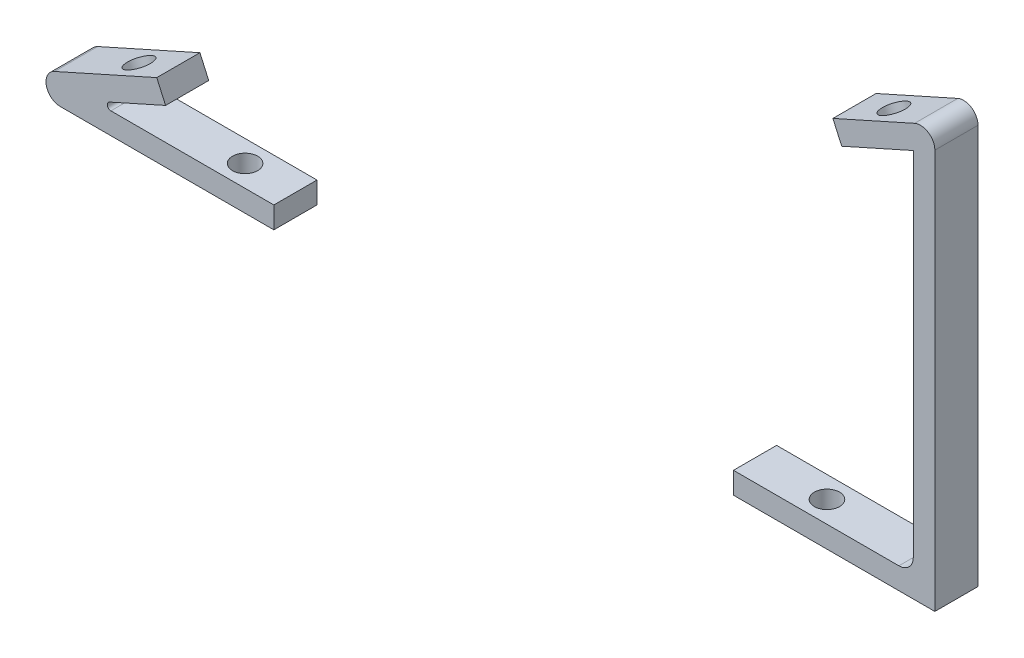
ISO-10303-21;
HEADER;
FILE_DESCRIPTION(('STEP AP214'),'2;1');
FILE_NAME('part.step','',(''),(''),'','','');
FILE_SCHEMA(('AUTOMOTIVE_DESIGN { 1 0 10303 214 1 1 1 1 }'));
ENDSEC;
DATA;
#1=APPLICATION_CONTEXT('core data for automotive mechanical design processes');
#2=APPLICATION_PROTOCOL_DEFINITION('international standard','automotive_design',2000,#1);
#3=PRODUCT_CONTEXT('',#1,'mechanical');
#4=PRODUCT('Part','Part','',(#3));
#5=PRODUCT_RELATED_PRODUCT_CATEGORY('part','',(#4));
#6=PRODUCT_DEFINITION_FORMATION('','',#4);
#7=PRODUCT_DEFINITION_CONTEXT('part definition',#1,'design');
#8=PRODUCT_DEFINITION('design','',#6,#7);
#9=PRODUCT_DEFINITION_SHAPE('','',#8);
#10=(LENGTH_UNIT() NAMED_UNIT(*) SI_UNIT(.MILLI.,.METRE.));
#11=(NAMED_UNIT(*) PLANE_ANGLE_UNIT() SI_UNIT($,.RADIAN.));
#12=(NAMED_UNIT(*) SI_UNIT($,.STERADIAN.) SOLID_ANGLE_UNIT());
#13=UNCERTAINTY_MEASURE_WITH_UNIT(LENGTH_MEASURE(1.E-05),#10,'distance_accuracy_value','');
#14=(GEOMETRIC_REPRESENTATION_CONTEXT(3) GLOBAL_UNCERTAINTY_ASSIGNED_CONTEXT((#13)) GLOBAL_UNIT_ASSIGNED_CONTEXT((#10,
#11,#12)) REPRESENTATION_CONTEXT('',''));
#15=CARTESIAN_POINT('',(0.,0.,0.));
#16=DIRECTION('',(0.,0.,1.));
#17=DIRECTION('',(1.,0.,0.));
#18=AXIS2_PLACEMENT_3D('',#15,#16,#17);
#19=CARTESIAN_POINT('',(89.9,52.5434299792377,6.));
#20=DIRECTION('',(0.,0.,1.));
#21=DIRECTION('',(1.,0.,0.));
#22=AXIS2_PLACEMENT_3D('',#19,#20,#21);
#23=CYLINDRICAL_SURFACE('',#22,2.);
#24=DIRECTION('',(0.,0.,1.));
#25=VECTOR('',#24,1.);
#26=CARTESIAN_POINT('',(91.9,52.5434299792376,6.));
#27=LINE('',#26,#25);
#28=CARTESIAN_POINT('',(91.9,52.5434299792376,0.));
#29=VERTEX_POINT('',#28);
#30=CARTESIAN_POINT('',(91.9,52.5434299792376,6.));
#31=VERTEX_POINT('',#30);
#32=EDGE_CURVE('E153',#29,#31,#27,.T.);
#33=ORIENTED_EDGE('',*,*,#32,.F.);
#34=CARTESIAN_POINT('',(89.9,52.5434299792377,0.));
#35=DIRECTION('',(0.,0.,1.));
#36=DIRECTION('',(1.,0.,0.));
#37=AXIS2_PLACEMENT_3D('',#34,#35,#36);
#38=CIRCLE('',#37,2.);
#39=CARTESIAN_POINT('',(89.0826705294979,54.3687991300257,0.));
#40=VERTEX_POINT('',#39);
#41=EDGE_CURVE('E167',#40,#29,#38,.F.);
#42=ORIENTED_EDGE('',*,*,#41,.F.);
#43=DIRECTION('',(0.,0.,1.));
#44=VECTOR('',#43,1.);
#45=CARTESIAN_POINT('',(89.0826705294979,54.3687991300257,6.));
#46=LINE('',#45,#44);
#47=CARTESIAN_POINT('',(89.0826705294979,54.3687991300257,6.));
#48=VERTEX_POINT('',#47);
#49=EDGE_CURVE('E158',#48,#40,#46,.F.);
#50=ORIENTED_EDGE('',*,*,#49,.F.);
#51=CARTESIAN_POINT('',(89.9,52.5434299792377,6.));
#52=DIRECTION('',(0.,0.,1.));
#53=DIRECTION('',(1.,0.,0.));
#54=AXIS2_PLACEMENT_3D('',#51,#52,#53);
#55=CIRCLE('',#54,2.);
#56=EDGE_CURVE('E170',#31,#48,#55,.T.);
#57=ORIENTED_EDGE('',*,*,#56,.F.);
#58=EDGE_LOOP('',(#33,#42,#50,#57));
#59=FACE_BOUND('',#58,.T.);
#60=ADVANCED_FACE('F48',(#59),#23,.T.);
#61=CARTESIAN_POINT('',(88.9,0.,6.));
#62=DIRECTION('',(0.,-1.,0.));
#63=DIRECTION('',(1.,0.,0.));
#64=AXIS2_PLACEMENT_3D('',#61,#62,#63);
#65=PLANE('',#64);
#66=CARTESIAN_POINT('',(73.9,0.,3.));
#67=DIRECTION('',(0.,1.,0.));
#68=DIRECTION('',(-1.,0.,0.));
#69=AXIS2_PLACEMENT_3D('',#66,#67,#68);
#70=CIRCLE('',#69,1.75);
#71=CARTESIAN_POINT('',(72.15,0.,3.));
#72=VERTEX_POINT('',#71);
#73=EDGE_CURVE('E306',#72,#72,#70,.T.);
#74=ORIENTED_EDGE('',*,*,#73,.F.);
#75=EDGE_LOOP('',(#74));
#76=FACE_BOUND('',#75,.T.);
#77=DIRECTION('',(-1.,0.,0.));
#78=VECTOR('',#77,1.);
#79=CARTESIAN_POINT('',(88.9,0.,6.));
#80=LINE('',#79,#78);
#81=CARTESIAN_POINT('',(86.9,0.,6.));
#82=VERTEX_POINT('',#81);
#83=CARTESIAN_POINT('',(63.9,0.,6.));
#84=VERTEX_POINT('',#83);
#85=EDGE_CURVE('E125',#82,#84,#80,.T.);
#86=ORIENTED_EDGE('',*,*,#85,.F.);
#87=DIRECTION('',(0.,0.,-1.));
#88=VECTOR('',#87,1.);
#89=CARTESIAN_POINT('',(86.9,0.,0.));
#90=LINE('',#89,#88);
#91=CARTESIAN_POINT('',(86.9,0.,0.));
#92=VERTEX_POINT('',#91);
#93=EDGE_CURVE('E173',#82,#92,#90,.T.);
#94=ORIENTED_EDGE('',*,*,#93,.T.);
#95=DIRECTION('',(-1.,0.,0.));
#96=VECTOR('',#95,1.);
#97=CARTESIAN_POINT('',(88.9,0.,0.));
#98=LINE('',#97,#96);
#99=CARTESIAN_POINT('',(63.9,0.,0.));
#100=VERTEX_POINT('',#99);
#101=EDGE_CURVE('E150',#92,#100,#98,.T.);
#102=ORIENTED_EDGE('',*,*,#101,.T.);
#103=DIRECTION('',(0.,0.,-1.));
#104=VECTOR('',#103,1.);
#105=CARTESIAN_POINT('',(63.9,0.,6.));
#106=LINE('',#105,#104);
#107=EDGE_CURVE('E142',#84,#100,#106,.T.);
#108=ORIENTED_EDGE('',*,*,#107,.F.);
#109=EDGE_LOOP('',(#86,#94,#102,#108));
#110=FACE_BOUND('',#109,.T.);
#111=ADVANCED_FACE('F149',(#76,#110),#65,.F.);
#112=CARTESIAN_POINT('',(63.9,0.,6.));
#113=DIRECTION('',(1.,0.,0.));
#114=DIRECTION('',(0.,0.,-1.));
#115=AXIS2_PLACEMENT_3D('',#112,#113,#114);
#116=PLANE('',#115);
#117=DIRECTION('',(0.,-1.,0.));
#118=VECTOR('',#117,1.);
#119=CARTESIAN_POINT('',(63.9,0.,0.));
#120=LINE('',#119,#118);
#121=CARTESIAN_POINT('',(63.9,-3.,0.));
#122=VERTEX_POINT('',#121);
#123=EDGE_CURVE('E182',#100,#122,#120,.T.);
#124=ORIENTED_EDGE('',*,*,#123,.T.);
#125=DIRECTION('',(0.,0.,-1.));
#126=VECTOR('',#125,1.);
#127=CARTESIAN_POINT('',(63.9,-3.,6.));
#128=LINE('',#127,#126);
#129=CARTESIAN_POINT('',(63.9,-3.,6.));
#130=VERTEX_POINT('',#129);
#131=EDGE_CURVE('E144',#130,#122,#128,.T.);
#132=ORIENTED_EDGE('',*,*,#131,.F.);
#133=DIRECTION('',(0.,-1.,0.));
#134=VECTOR('',#133,1.);
#135=CARTESIAN_POINT('',(63.9,0.,6.));
#136=LINE('',#135,#134);
#137=EDGE_CURVE('E129',#84,#130,#136,.T.);
#138=ORIENTED_EDGE('',*,*,#137,.F.);
#139=ORIENTED_EDGE('',*,*,#107,.T.);
#140=EDGE_LOOP('',(#124,#132,#138,#139));
#141=FACE_BOUND('',#140,.T.);
#142=ADVANCED_FACE('F141',(#141),#116,.F.);
#143=CARTESIAN_POINT('',(63.9,-3.,6.));
#144=DIRECTION('',(0.,1.,0.));
#145=DIRECTION('',(-1.,0.,0.));
#146=AXIS2_PLACEMENT_3D('',#143,#144,#145);
#147=PLANE('',#146);
#148=CARTESIAN_POINT('',(73.9,-2.99999999999999,3.));
#149=DIRECTION('',(0.,1.,0.));
#150=DIRECTION('',(-1.,0.,0.));
#151=AXIS2_PLACEMENT_3D('',#148,#149,#150);
#152=CIRCLE('',#151,1.75);
#153=CARTESIAN_POINT('',(72.15,-2.99999999999999,3.));
#154=VERTEX_POINT('',#153);
#155=EDGE_CURVE('E303',#154,#154,#152,.T.);
#156=ORIENTED_EDGE('',*,*,#155,.T.);
#157=EDGE_LOOP('',(#156));
#158=FACE_BOUND('',#157,.T.);
#159=DIRECTION('',(1.,0.,0.));
#160=VECTOR('',#159,1.);
#161=CARTESIAN_POINT('',(63.9,-3.,0.));
#162=LINE('',#161,#160);
#163=CARTESIAN_POINT('',(91.9,-3.00000000000001,0.));
#164=VERTEX_POINT('',#163);
#165=EDGE_CURVE('E188',#122,#164,#162,.T.);
#166=ORIENTED_EDGE('',*,*,#165,.T.);
#167=DIRECTION('',(0.,0.,-1.));
#168=VECTOR('',#167,1.);
#169=CARTESIAN_POINT('',(91.9,-3.00000000000001,6.));
#170=LINE('',#169,#168);
#171=CARTESIAN_POINT('',(91.9,-3.00000000000001,6.));
#172=VERTEX_POINT('',#171);
#173=EDGE_CURVE('E160',#172,#164,#170,.T.);
#174=ORIENTED_EDGE('',*,*,#173,.F.);
#175=DIRECTION('',(1.,0.,0.));
#176=VECTOR('',#175,1.);
#177=CARTESIAN_POINT('',(63.9,-3.,6.));
#178=LINE('',#177,#176);
#179=EDGE_CURVE('E147',#130,#172,#178,.T.);
#180=ORIENTED_EDGE('',*,*,#179,.F.);
#181=ORIENTED_EDGE('',*,*,#131,.T.);
#182=EDGE_LOOP('',(#166,#174,#180,#181));
#183=FACE_BOUND('',#182,.T.);
#184=ADVANCED_FACE('F235',(#158,#183),#147,.F.);
#185=CARTESIAN_POINT('',(91.9000000000001,55.6302899377132,6.));
#186=DIRECTION('',(-1.,0.,0.));
#187=DIRECTION('',(0.,-1.,0.));
#188=AXIS2_PLACEMENT_3D('',#185,#186,#187);
#189=PLANE('',#188);
#190=DIRECTION('',(0.,1.,0.));
#191=VECTOR('',#190,1.);
#192=CARTESIAN_POINT('',(91.9000000000001,55.6302899377132,0.));
#193=LINE('',#192,#191);
#194=EDGE_CURVE('E200',#164,#29,#193,.T.);
#195=ORIENTED_EDGE('',*,*,#194,.T.);
#196=ORIENTED_EDGE('',*,*,#32,.T.);
#197=DIRECTION('',(0.,1.,0.));
#198=VECTOR('',#197,1.);
#199=CARTESIAN_POINT('',(91.9,-3.00000000000001,6.));
#200=LINE('',#199,#198);
#201=EDGE_CURVE('E233',#172,#31,#200,.T.);
#202=ORIENTED_EDGE('',*,*,#201,.F.);
#203=ORIENTED_EDGE('',*,*,#173,.T.);
#204=EDGE_LOOP('',(#195,#196,#202,#203));
#205=FACE_BOUND('',#204,.T.);
#206=ADVANCED_FACE('F232',(#205),#189,.F.);
#207=CARTESIAN_POINT('',(77.7272614270395,49.2842875916115,6.));
#208=DIRECTION('',(0.408664735251058,-0.912684575394031,0.));
#209=DIRECTION('',(0.912684575394031,0.408664735251058,0.));
#210=AXIS2_PLACEMENT_3D('',#207,#208,#209);
#211=PLANE('',#210);
#212=CARTESIAN_POINT('',(83.2033688794036,51.7362760031179,3.));
#213=DIRECTION('',(-0.408664735251058,0.912684575394031,0.));
#214=DIRECTION('',(-0.912684575394031,-0.408664735251058,0.));
#215=AXIS2_PLACEMENT_3D('',#212,#213,#214);
#216=CIRCLE('',#215,1.75);
#217=CARTESIAN_POINT('',(81.6061708724641,51.0211127164285,3.));
#218=VERTEX_POINT('',#217);
#219=EDGE_CURVE('E191',#218,#218,#216,.T.);
#220=ORIENTED_EDGE('',*,*,#219,.F.);
#221=EDGE_LOOP('',(#220));
#222=FACE_BOUND('',#221,.T.);
#223=DIRECTION('',(-0.912684575394032,-0.408664735251057,0.));
#224=VECTOR('',#223,1.);
#225=CARTESIAN_POINT('',(83.2033688794036,51.7362760031178,6.));
#226=LINE('',#225,#224);
#227=CARTESIAN_POINT('',(77.7272614270395,49.2842875916115,6.));
#228=VERTEX_POINT('',#227);
#229=EDGE_CURVE('E241',#48,#228,#226,.T.);
#230=ORIENTED_EDGE('',*,*,#229,.F.);
#231=ORIENTED_EDGE('',*,*,#49,.T.);
#232=DIRECTION('',(-0.912684575394031,-0.408664735251058,0.));
#233=VECTOR('',#232,1.);
#234=CARTESIAN_POINT('',(77.7272614270395,49.2842875916115,0.));
#235=LINE('',#234,#233);
#236=CARTESIAN_POINT('',(77.7272614270395,49.2842875916115,0.));
#237=VERTEX_POINT('',#236);
#238=EDGE_CURVE('E204',#40,#237,#235,.T.);
#239=ORIENTED_EDGE('',*,*,#238,.T.);
#240=DIRECTION('',(0.,0.,-1.));
#241=VECTOR('',#240,1.);
#242=CARTESIAN_POINT('',(77.7272614270395,49.2842875916115,6.));
#243=LINE('',#242,#241);
#244=EDGE_CURVE('E224',#228,#237,#243,.T.);
#245=ORIENTED_EDGE('',*,*,#244,.F.);
#246=EDGE_LOOP('',(#230,#231,#239,#245));
#247=FACE_BOUND('',#246,.T.);
#248=ADVANCED_FACE('F279',(#222,#247),#211,.F.);
#249=CARTESIAN_POINT('',(78.9532556327926,46.5462338654294,6.));
#250=DIRECTION('',(0.912684575394031,0.408664735251059,0.));
#251=DIRECTION('',(-0.408664735251059,0.912684575394031,0.));
#252=AXIS2_PLACEMENT_3D('',#249,#250,#251);
#253=PLANE('',#252);
#254=DIRECTION('',(0.408664735251059,-0.912684575394031,0.));
#255=VECTOR('',#254,1.);
#256=CARTESIAN_POINT('',(78.9532556327926,46.5462338654294,0.));
#257=LINE('',#256,#255);
#258=CARTESIAN_POINT('',(78.9532556327926,46.5462338654294,0.));
#259=VERTEX_POINT('',#258);
#260=EDGE_CURVE('E207',#237,#259,#257,.T.);
#261=ORIENTED_EDGE('',*,*,#260,.T.);
#262=DIRECTION('',(0.,0.,-1.));
#263=VECTOR('',#262,1.);
#264=CARTESIAN_POINT('',(78.9532556327926,46.5462338654294,6.));
#265=LINE('',#264,#263);
#266=CARTESIAN_POINT('',(78.9532556327926,46.5462338654294,6.));
#267=VERTEX_POINT('',#266);
#268=EDGE_CURVE('E220',#267,#259,#265,.T.);
#269=ORIENTED_EDGE('',*,*,#268,.F.);
#270=DIRECTION('',(0.408664735251059,-0.912684575394031,0.));
#271=VECTOR('',#270,1.);
#272=CARTESIAN_POINT('',(78.9532556327926,46.5462338654294,6.));
#273=LINE('',#272,#271);
#274=EDGE_CURVE('E245',#228,#267,#273,.T.);
#275=ORIENTED_EDGE('',*,*,#274,.F.);
#276=ORIENTED_EDGE('',*,*,#244,.T.);
#277=EDGE_LOOP('',(#261,#269,#275,#276));
#278=FACE_BOUND('',#277,.T.);
#279=ADVANCED_FACE('F282',(#278),#253,.F.);
#280=CARTESIAN_POINT('',(88.9000000000001,50.9999999999999,6.));
#281=DIRECTION('',(-0.408664735251058,0.912684575394031,0.));
#282=DIRECTION('',(-0.912684575394031,-0.408664735251058,0.));
#283=AXIS2_PLACEMENT_3D('',#280,#281,#282);
#284=PLANE('',#283);
#285=CARTESIAN_POINT('',(84.4293630851568,48.9982222769358,3.));
#286=DIRECTION('',(-0.408664735251058,0.912684575394031,0.));
#287=DIRECTION('',(-0.912684575394031,-0.408664735251058,0.));
#288=AXIS2_PLACEMENT_3D('',#285,#286,#287);
#289=CIRCLE('',#288,1.75);
#290=CARTESIAN_POINT('',(82.8321650782173,48.2830589902464,3.));
#291=VERTEX_POINT('',#290);
#292=EDGE_CURVE('E184',#291,#291,#289,.T.);
#293=ORIENTED_EDGE('',*,*,#292,.T.);
#294=EDGE_LOOP('',(#293));
#295=FACE_BOUND('',#294,.T.);
#296=DIRECTION('',(0.912684575394031,0.408664735251058,0.));
#297=VECTOR('',#296,1.);
#298=CARTESIAN_POINT('',(88.9000000000001,50.9999999999999,0.));
#299=LINE('',#298,#297);
#300=CARTESIAN_POINT('',(88.9000000000001,50.9999999999999,0.));
#301=VERTEX_POINT('',#300);
#302=EDGE_CURVE('E211',#259,#301,#299,.T.);
#303=ORIENTED_EDGE('',*,*,#302,.T.);
#304=DIRECTION('',(0.,0.,-1.));
#305=VECTOR('',#304,1.);
#306=CARTESIAN_POINT('',(88.9000000000001,50.9999999999999,6.));
#307=LINE('',#306,#305);
#308=CARTESIAN_POINT('',(88.9000000000001,50.9999999999999,6.));
#309=VERTEX_POINT('',#308);
#310=EDGE_CURVE('E216',#309,#301,#307,.T.);
#311=ORIENTED_EDGE('',*,*,#310,.F.);
#312=DIRECTION('',(0.912684575394032,0.408664735251057,0.));
#313=VECTOR('',#312,1.);
#314=CARTESIAN_POINT('',(84.4293630851568,48.9982222769358,6.));
#315=LINE('',#314,#313);
#316=EDGE_CURVE('E250',#267,#309,#315,.T.);
#317=ORIENTED_EDGE('',*,*,#316,.F.);
#318=ORIENTED_EDGE('',*,*,#268,.T.);
#319=EDGE_LOOP('',(#303,#311,#317,#318));
#320=FACE_BOUND('',#319,.T.);
#321=ADVANCED_FACE('F286',(#295,#320),#284,.F.);
#322=CARTESIAN_POINT('',(88.9,0.,6.));
#323=DIRECTION('',(1.,0.,0.));
#324=DIRECTION('',(0.,1.,0.));
#325=AXIS2_PLACEMENT_3D('',#322,#323,#324);
#326=PLANE('',#325);
#327=DIRECTION('',(0.,-1.,0.));
#328=VECTOR('',#327,1.);
#329=CARTESIAN_POINT('',(88.9,0.,0.));
#330=LINE('',#329,#328);
#331=CARTESIAN_POINT('',(88.9,2.,0.));
#332=VERTEX_POINT('',#331);
#333=EDGE_CURVE('E137',#301,#332,#330,.T.);
#334=ORIENTED_EDGE('',*,*,#333,.T.);
#335=DIRECTION('',(0.,0.,-1.));
#336=VECTOR('',#335,1.);
#337=CARTESIAN_POINT('',(88.9,2.,6.));
#338=LINE('',#337,#336);
#339=CARTESIAN_POINT('',(88.9,2.,6.));
#340=VERTEX_POINT('',#339);
#341=EDGE_CURVE('E64',#332,#340,#338,.F.);
#342=ORIENTED_EDGE('',*,*,#341,.T.);
#343=DIRECTION('',(0.,-1.,0.));
#344=VECTOR('',#343,1.);
#345=CARTESIAN_POINT('',(88.9,0.,6.));
#346=LINE('',#345,#344);
#347=EDGE_CURVE('E194',#309,#340,#346,.T.);
#348=ORIENTED_EDGE('',*,*,#347,.F.);
#349=ORIENTED_EDGE('',*,*,#310,.T.);
#350=EDGE_LOOP('',(#334,#342,#348,#349));
#351=FACE_BOUND('',#350,.T.);
#352=ADVANCED_FACE('F290',(#351),#326,.F.);
#353=CARTESIAN_POINT('',(0.,0.,6.));
#354=DIRECTION('',(0.,0.,1.));
#355=DIRECTION('',(1.,0.,0.));
#356=AXIS2_PLACEMENT_3D('',#353,#354,#355);
#357=PLANE('',#356);
#358=ORIENTED_EDGE('',*,*,#201,.T.);
#359=ORIENTED_EDGE('',*,*,#56,.T.);
#360=ORIENTED_EDGE('',*,*,#229,.T.);
#361=ORIENTED_EDGE('',*,*,#274,.T.);
#362=ORIENTED_EDGE('',*,*,#316,.T.);
#363=ORIENTED_EDGE('',*,*,#347,.T.);
#364=CARTESIAN_POINT('',(86.9,2.,6.));
#365=DIRECTION('',(0.,0.,1.));
#366=DIRECTION('',(1.,0.,0.));
#367=AXIS2_PLACEMENT_3D('',#364,#365,#366);
#368=CIRCLE('',#367,2.);
#369=EDGE_CURVE('E12',#340,#82,#368,.F.);
#370=ORIENTED_EDGE('',*,*,#369,.T.);
#371=ORIENTED_EDGE('',*,*,#85,.T.);
#372=ORIENTED_EDGE('',*,*,#137,.T.);
#373=ORIENTED_EDGE('',*,*,#179,.T.);
#374=EDGE_LOOP('',(#358,#359,#360,#361,#362,#363,#370,#371,#372,#373));
#375=FACE_BOUND('',#374,.T.);
#376=ADVANCED_FACE('F128',(#375),#357,.T.);
#377=CARTESIAN_POINT('',(0.,0.,0.));
#378=DIRECTION('',(0.,0.,1.));
#379=DIRECTION('',(1.,0.,0.));
#380=AXIS2_PLACEMENT_3D('',#377,#378,#379);
#381=PLANE('',#380);
#382=ORIENTED_EDGE('',*,*,#238,.F.);
#383=ORIENTED_EDGE('',*,*,#41,.T.);
#384=ORIENTED_EDGE('',*,*,#194,.F.);
#385=ORIENTED_EDGE('',*,*,#165,.F.);
#386=ORIENTED_EDGE('',*,*,#123,.F.);
#387=ORIENTED_EDGE('',*,*,#101,.F.);
#388=CARTESIAN_POINT('',(86.9,2.,0.));
#389=DIRECTION('',(0.,0.,1.));
#390=DIRECTION('',(1.,0.,0.));
#391=AXIS2_PLACEMENT_3D('',#388,#389,#390);
#392=CIRCLE('',#391,2.);
#393=EDGE_CURVE('E57',#92,#332,#392,.T.);
#394=ORIENTED_EDGE('',*,*,#393,.T.);
#395=ORIENTED_EDGE('',*,*,#333,.F.);
#396=ORIENTED_EDGE('',*,*,#302,.F.);
#397=ORIENTED_EDGE('',*,*,#260,.F.);
#398=EDGE_LOOP('',(#382,#383,#384,#385,#386,#387,#394,#395,#396,#397));
#399=FACE_BOUND('',#398,.T.);
#400=ADVANCED_FACE('F180',(#399),#381,.F.);
#401=CARTESIAN_POINT('',(86.9,2.,6.));
#402=DIRECTION('',(0.,0.,1.));
#403=DIRECTION('',(1.,0.,0.));
#404=AXIS2_PLACEMENT_3D('',#401,#402,#403);
#405=CYLINDRICAL_SURFACE('',#404,2.);
#406=ORIENTED_EDGE('',*,*,#369,.F.);
#407=ORIENTED_EDGE('',*,*,#341,.F.);
#408=ORIENTED_EDGE('',*,*,#393,.F.);
#409=ORIENTED_EDGE('',*,*,#93,.F.);
#410=EDGE_LOOP('',(#406,#407,#408,#409));
#411=FACE_BOUND('',#410,.T.);
#412=ADVANCED_FACE('F50',(#411),#405,.F.);
#413=CARTESIAN_POINT('',(84.4293630851568,48.9982222769358,3.));
#414=DIRECTION('',(-0.408664735251058,0.912684575394031,0.));
#415=DIRECTION('',(-0.912684575394031,-0.408664735251058,0.));
#416=AXIS2_PLACEMENT_3D('',#413,#414,#415);
#417=CYLINDRICAL_SURFACE('',#416,1.75);
#418=ORIENTED_EDGE('',*,*,#292,.F.);
#419=EDGE_LOOP('',(#418));
#420=FACE_BOUND('',#419,.T.);
#421=ORIENTED_EDGE('',*,*,#219,.T.);
#422=EDGE_LOOP('',(#421));
#423=FACE_BOUND('',#422,.T.);
#424=ADVANCED_FACE('F256',(#420,#423),#417,.F.);
#425=CARTESIAN_POINT('',(73.9,-2.99999999999999,3.));
#426=DIRECTION('',(0.,1.,0.));
#427=DIRECTION('',(-1.,0.,0.));
#428=AXIS2_PLACEMENT_3D('',#425,#426,#427);
#429=CYLINDRICAL_SURFACE('',#428,1.75);
#430=ORIENTED_EDGE('',*,*,#155,.F.);
#431=EDGE_LOOP('',(#430));
#432=FACE_BOUND('',#431,.T.);
#433=ORIENTED_EDGE('',*,*,#73,.T.);
#434=EDGE_LOOP('',(#433));
#435=FACE_BOUND('',#434,.T.);
#436=ADVANCED_FACE('F261',(#432,#435),#429,.F.);
#437=CLOSED_SHELL('',(#60,#111,#142,#184,#206,#248,#279,#321,#352,#376,#400,#412,#424,#436));
#438=MANIFOLD_SOLID_BREP('B2',#437);
#439=CARTESIAN_POINT('',(-29.680326953631,-1.,6.));
#440=DIRECTION('',(0.,0.,1.));
#441=DIRECTION('',(1.,0.,0.));
#442=AXIS2_PLACEMENT_3D('',#439,#440,#441);
#443=CYLINDRICAL_SURFACE('',#442,2.);
#444=DIRECTION('',(0.,0.,1.));
#445=VECTOR('',#444,1.);
#446=CARTESIAN_POINT('',(-30.4976564241332,0.825369150788062,6.));
#447=LINE('',#446,#445);
#448=CARTESIAN_POINT('',(-30.4976564241332,0.825369150788061,0.));
#449=VERTEX_POINT('',#448);
#450=CARTESIAN_POINT('',(-30.4976564241332,0.825369150788061,6.));
#451=VERTEX_POINT('',#450);
#452=EDGE_CURVE('E496',#449,#451,#447,.T.);
#453=ORIENTED_EDGE('',*,*,#452,.F.);
#454=CARTESIAN_POINT('',(-29.680326953631,-1.,0.));
#455=DIRECTION('',(0.,0.,-1.));
#456=DIRECTION('',(-1.,0.,0.));
#457=AXIS2_PLACEMENT_3D('',#454,#455,#456);
#458=CIRCLE('',#457,2.);
#459=CARTESIAN_POINT('',(-29.6803269536311,-3.,0.));
#460=VERTEX_POINT('',#459);
#461=EDGE_CURVE('E535',#460,#449,#458,.T.);
#462=ORIENTED_EDGE('',*,*,#461,.F.);
#463=DIRECTION('',(0.,0.,1.));
#464=VECTOR('',#463,1.);
#465=CARTESIAN_POINT('',(-29.680326953631,-3.,6.));
#466=LINE('',#465,#464);
#467=CARTESIAN_POINT('',(-29.6803269536311,-3.,6.));
#468=VERTEX_POINT('',#467);
#469=EDGE_CURVE('E533',#468,#460,#466,.F.);
#470=ORIENTED_EDGE('',*,*,#469,.F.);
#471=CARTESIAN_POINT('',(-29.680326953631,-1.,6.));
#472=DIRECTION('',(0.,0.,-1.));
#473=DIRECTION('',(-1.,0.,0.));
#474=AXIS2_PLACEMENT_3D('',#471,#472,#473);
#475=CIRCLE('',#474,2.);
#476=EDGE_CURVE('E483',#451,#468,#475,.F.);
#477=ORIENTED_EDGE('',*,*,#476,.F.);
#478=EDGE_LOOP('',(#453,#462,#470,#477));
#479=FACE_BOUND('',#478,.T.);
#480=ADVANCED_FACE('F412',(#479),#443,.T.);
#481=CARTESIAN_POINT('',(0.,-3.,6.));
#482=DIRECTION('',(0.,1.,0.));
#483=DIRECTION('',(0.,0.,1.));
#484=AXIS2_PLACEMENT_3D('',#481,#482,#483);
#485=PLANE('',#484);
#486=CARTESIAN_POINT('',(-7.,-3.,3.));
#487=DIRECTION('',(0.,1.,0.));
#488=DIRECTION('',(-1.,0.,0.));
#489=AXIS2_PLACEMENT_3D('',#486,#487,#488);
#490=CIRCLE('',#489,1.75);
#491=CARTESIAN_POINT('',(-8.75,-3.,3.));
#492=VERTEX_POINT('',#491);
#493=EDGE_CURVE('E600',#492,#492,#490,.T.);
#494=ORIENTED_EDGE('',*,*,#493,.T.);
#495=EDGE_LOOP('',(#494));
#496=FACE_BOUND('',#495,.T.);
#497=DIRECTION('',(1.,0.,0.));
#498=VECTOR('',#497,1.);
#499=CARTESIAN_POINT('',(-39.0409808608932,-3.,6.));
#500=LINE('',#499,#498);
#501=CARTESIAN_POINT('',(0.,-3.,6.));
#502=VERTEX_POINT('',#501);
#503=EDGE_CURVE('E476',#468,#502,#500,.T.);
#504=ORIENTED_EDGE('',*,*,#503,.F.);
#505=ORIENTED_EDGE('',*,*,#469,.T.);
#506=DIRECTION('',(1.,0.,0.));
#507=VECTOR('',#506,1.);
#508=CARTESIAN_POINT('',(0.,-3.,0.));
#509=LINE('',#508,#507);
#510=CARTESIAN_POINT('',(0.,-3.,0.));
#511=VERTEX_POINT('',#510);
#512=EDGE_CURVE('E493',#460,#511,#509,.T.);
#513=ORIENTED_EDGE('',*,*,#512,.T.);
#514=DIRECTION('',(0.,0.,-1.));
#515=VECTOR('',#514,1.);
#516=CARTESIAN_POINT('',(0.,-3.,6.));
#517=LINE('',#516,#515);
#518=EDGE_CURVE('E490',#502,#511,#517,.T.);
#519=ORIENTED_EDGE('',*,*,#518,.F.);
#520=EDGE_LOOP('',(#504,#505,#513,#519));
#521=FACE_BOUND('',#520,.T.);
#522=ADVANCED_FACE('F491',(#496,#521),#485,.F.);
#523=CARTESIAN_POINT('',(0.,0.,6.));
#524=DIRECTION('',(-1.,0.,0.));
#525=DIRECTION('',(0.,-1.,0.));
#526=AXIS2_PLACEMENT_3D('',#523,#524,#525);
#527=PLANE('',#526);
#528=DIRECTION('',(0.,1.,0.));
#529=VECTOR('',#528,1.);
#530=CARTESIAN_POINT('',(0.,0.,0.));
#531=LINE('',#530,#529);
#532=CARTESIAN_POINT('',(0.,0.,0.));
#533=VERTEX_POINT('',#532);
#534=EDGE_CURVE('E514',#511,#533,#531,.T.);
#535=ORIENTED_EDGE('',*,*,#534,.T.);
#536=DIRECTION('',(0.,0.,-1.));
#537=VECTOR('',#536,1.);
#538=CARTESIAN_POINT('',(0.,0.,6.));
#539=LINE('',#538,#537);
#540=CARTESIAN_POINT('',(0.,0.,6.));
#541=VERTEX_POINT('',#540);
#542=EDGE_CURVE('E497',#541,#533,#539,.T.);
#543=ORIENTED_EDGE('',*,*,#542,.F.);
#544=DIRECTION('',(0.,1.,0.));
#545=VECTOR('',#544,1.);
#546=CARTESIAN_POINT('',(0.,0.,6.));
#547=LINE('',#546,#545);
#548=EDGE_CURVE('E481',#502,#541,#547,.T.);
#549=ORIENTED_EDGE('',*,*,#548,.F.);
#550=ORIENTED_EDGE('',*,*,#518,.T.);
#551=EDGE_LOOP('',(#535,#543,#549,#550));
#552=FACE_BOUND('',#551,.T.);
#553=ADVANCED_FACE('F499',(#552),#527,.F.);
#554=CARTESIAN_POINT('',(-25.,0.,6.));
#555=DIRECTION('',(0.,-1.,0.));
#556=DIRECTION('',(0.,0.,-1.));
#557=AXIS2_PLACEMENT_3D('',#554,#555,#556);
#558=PLANE('',#557);
#559=CARTESIAN_POINT('',(-7.,0.,3.));
#560=DIRECTION('',(0.,1.,0.));
#561=DIRECTION('',(-1.,0.,0.));
#562=AXIS2_PLACEMENT_3D('',#559,#560,#561);
#563=CIRCLE('',#562,1.75);
#564=CARTESIAN_POINT('',(-8.75,0.,3.));
#565=VERTEX_POINT('',#564);
#566=EDGE_CURVE('E603',#565,#565,#563,.T.);
#567=ORIENTED_EDGE('',*,*,#566,.F.);
#568=EDGE_LOOP('',(#567));
#569=FACE_BOUND('',#568,.T.);
#570=DIRECTION('',(-1.,0.,0.));
#571=VECTOR('',#570,1.);
#572=CARTESIAN_POINT('',(-25.,0.,0.));
#573=LINE('',#572,#571);
#574=CARTESIAN_POINT('',(-22.6598365231845,0.,0.));
#575=VERTEX_POINT('',#574);
#576=EDGE_CURVE('E517',#533,#575,#573,.T.);
#577=ORIENTED_EDGE('',*,*,#576,.T.);
#578=DIRECTION('',(0.,0.,-1.));
#579=VECTOR('',#578,1.);
#580=CARTESIAN_POINT('',(-22.6598365231845,0.,6.));
#581=LINE('',#580,#579);
#582=CARTESIAN_POINT('',(-22.6598365231845,0.,6.));
#583=VERTEX_POINT('',#582);
#584=EDGE_CURVE('E427',#575,#583,#581,.F.);
#585=ORIENTED_EDGE('',*,*,#584,.T.);
#586=DIRECTION('',(-1.,0.,0.));
#587=VECTOR('',#586,1.);
#588=CARTESIAN_POINT('',(-25.,0.,6.));
#589=LINE('',#588,#587);
#590=EDGE_CURVE('E501',#541,#583,#589,.T.);
#591=ORIENTED_EDGE('',*,*,#590,.F.);
#592=ORIENTED_EDGE('',*,*,#542,.T.);
#593=EDGE_LOOP('',(#577,#585,#591,#592));
#594=FACE_BOUND('',#593,.T.);
#595=ADVANCED_FACE('F579',(#569,#594),#558,.F.);
#596=CARTESIAN_POINT('',(-20.5293630851567,2.00177772306414,6.));
#597=DIRECTION('',(-0.408664735251057,0.912684575394031,0.));
#598=DIRECTION('',(-0.912684575394031,-0.408664735251057,0.));
#599=AXIS2_PLACEMENT_3D('',#596,#597,#598);
#600=PLANE('',#599);
#601=CARTESIAN_POINT('',(-20.5293630851567,2.00177772306411,3.00000000000001));
#602=DIRECTION('',(-0.408664735251058,0.912684575394031,0.));
#603=DIRECTION('',(-0.912684575394031,-0.408664735251058,0.));
#604=AXIS2_PLACEMENT_3D('',#601,#602,#603);
#605=CIRCLE('',#604,1.75);
#606=CARTESIAN_POINT('',(-22.1265610920963,1.28661443637476,3.00000000000001));
#607=VERTEX_POINT('',#606);
#608=EDGE_CURVE('E515',#607,#607,#605,.T.);
#609=ORIENTED_EDGE('',*,*,#608,.T.);
#610=EDGE_LOOP('',(#609));
#611=FACE_BOUND('',#610,.T.);
#612=DIRECTION('',(0.912684575394031,0.408664735251058,0.));
#613=VECTOR('',#612,1.);
#614=CARTESIAN_POINT('',(-20.5293630851567,2.00177772306414,6.));
#615=LINE('',#614,#613);
#616=CARTESIAN_POINT('',(-22.86416889081,0.956342287697015,6.));
#617=VERTEX_POINT('',#616);
#618=CARTESIAN_POINT('',(-15.0532556327926,4.45376613457048,6.));
#619=VERTEX_POINT('',#618);
#620=EDGE_CURVE('E503',#617,#619,#615,.T.);
#621=ORIENTED_EDGE('',*,*,#620,.F.);
#622=DIRECTION('',(0.,0.,-1.));
#623=VECTOR('',#622,1.);
#624=CARTESIAN_POINT('',(-22.86416889081,0.956342287697016,0.));
#625=LINE('',#624,#623);
#626=CARTESIAN_POINT('',(-22.86416889081,0.956342287697016,0.));
#627=VERTEX_POINT('',#626);
#628=EDGE_CURVE('E538',#617,#627,#625,.T.);
#629=ORIENTED_EDGE('',*,*,#628,.T.);
#630=DIRECTION('',(0.912684575394031,0.408664735251057,0.));
#631=VECTOR('',#630,1.);
#632=CARTESIAN_POINT('',(-20.5293630851567,2.00177772306414,0.));
#633=LINE('',#632,#631);
#634=CARTESIAN_POINT('',(-15.0532556327926,4.45376613457048,0.));
#635=VERTEX_POINT('',#634);
#636=EDGE_CURVE('E519',#627,#635,#633,.T.);
#637=ORIENTED_EDGE('',*,*,#636,.T.);
#638=DIRECTION('',(0.,0.,-1.));
#639=VECTOR('',#638,1.);
#640=CARTESIAN_POINT('',(-15.0532556327926,4.45376613457048,6.));
#641=LINE('',#640,#639);
#642=EDGE_CURVE('E527',#619,#635,#641,.T.);
#643=ORIENTED_EDGE('',*,*,#642,.F.);
#644=EDGE_LOOP('',(#621,#629,#637,#643));
#645=FACE_BOUND('',#644,.T.);
#646=ADVANCED_FACE('F544',(#611,#645),#600,.F.);
#647=CARTESIAN_POINT('',(-15.0532556327926,4.45376613457048,6.));
#648=DIRECTION('',(-0.912684575394031,-0.408664735251058,0.));
#649=DIRECTION('',(0.408664735251058,-0.912684575394031,0.));
#650=AXIS2_PLACEMENT_3D('',#647,#648,#649);
#651=PLANE('',#650);
#652=DIRECTION('',(-0.408664735251058,0.912684575394031,0.));
#653=VECTOR('',#652,1.);
#654=CARTESIAN_POINT('',(-15.0532556327926,4.45376613457048,0.));
#655=LINE('',#654,#653);
#656=CARTESIAN_POINT('',(-16.2792498385457,7.19181986075258,0.));
#657=VERTEX_POINT('',#656);
#658=EDGE_CURVE('E521',#635,#657,#655,.T.);
#659=ORIENTED_EDGE('',*,*,#658,.T.);
#660=DIRECTION('',(0.,0.,-1.));
#661=VECTOR('',#660,1.);
#662=CARTESIAN_POINT('',(-16.2792498385457,7.19181986075258,6.));
#663=LINE('',#662,#661);
#664=CARTESIAN_POINT('',(-16.2792498385457,7.19181986075258,6.));
#665=VERTEX_POINT('',#664);
#666=EDGE_CURVE('E512',#665,#657,#663,.T.);
#667=ORIENTED_EDGE('',*,*,#666,.F.);
#668=DIRECTION('',(-0.408664735251058,0.912684575394031,0.));
#669=VECTOR('',#668,1.);
#670=CARTESIAN_POINT('',(-15.0532556327926,4.45376613457048,6.));
#671=LINE('',#670,#669);
#672=EDGE_CURVE('E508',#619,#665,#671,.T.);
#673=ORIENTED_EDGE('',*,*,#672,.F.);
#674=ORIENTED_EDGE('',*,*,#642,.T.);
#675=EDGE_LOOP('',(#659,#667,#673,#674));
#676=FACE_BOUND('',#675,.T.);
#677=ADVANCED_FACE('F553',(#676),#651,.F.);
#678=CARTESIAN_POINT('',(-16.2792498385457,7.19181986075258,6.));
#679=DIRECTION('',(0.408664735251058,-0.912684575394031,0.));
#680=DIRECTION('',(0.912684575394031,0.408664735251058,0.));
#681=AXIS2_PLACEMENT_3D('',#678,#679,#680);
#682=PLANE('',#681);
#683=CARTESIAN_POINT('',(-21.7553572909099,4.7398314492462,3.00000000000001));
#684=DIRECTION('',(-0.408664735251058,0.912684575394031,0.));
#685=DIRECTION('',(-0.912684575394031,-0.408664735251058,0.));
#686=AXIS2_PLACEMENT_3D('',#683,#684,#685);
#687=CIRCLE('',#686,1.75);
#688=CARTESIAN_POINT('',(-23.3525552978495,4.02466816255685,3.00000000000001));
#689=VERTEX_POINT('',#688);
#690=EDGE_CURVE('E605',#689,#689,#687,.T.);
#691=ORIENTED_EDGE('',*,*,#690,.F.);
#692=EDGE_LOOP('',(#691));
#693=FACE_BOUND('',#692,.T.);
#694=DIRECTION('',(-0.912684575394031,-0.408664735251058,0.));
#695=VECTOR('',#694,1.);
#696=CARTESIAN_POINT('',(-16.2792498385457,7.19181986075258,0.));
#697=LINE('',#696,#695);
#698=EDGE_CURVE('E487',#657,#449,#697,.T.);
#699=ORIENTED_EDGE('',*,*,#698,.T.);
#700=ORIENTED_EDGE('',*,*,#452,.T.);
#701=DIRECTION('',(-0.912684575394031,-0.408664735251058,0.));
#702=VECTOR('',#701,1.);
#703=CARTESIAN_POINT('',(-16.2792498385457,7.19181986075258,6.));
#704=LINE('',#703,#702);
#705=EDGE_CURVE('E510',#665,#451,#704,.T.);
#706=ORIENTED_EDGE('',*,*,#705,.F.);
#707=ORIENTED_EDGE('',*,*,#666,.T.);
#708=EDGE_LOOP('',(#699,#700,#706,#707));
#709=FACE_BOUND('',#708,.T.);
#710=ADVANCED_FACE('F557',(#693,#709),#682,.F.);
#711=CARTESIAN_POINT('',(0.,0.,6.));
#712=DIRECTION('',(0.,0.,-1.));
#713=DIRECTION('',(-1.,0.,0.));
#714=AXIS2_PLACEMENT_3D('',#711,#712,#713);
#715=PLANE('',#714);
#716=ORIENTED_EDGE('',*,*,#705,.T.);
#717=ORIENTED_EDGE('',*,*,#476,.T.);
#718=ORIENTED_EDGE('',*,*,#503,.T.);
#719=ORIENTED_EDGE('',*,*,#548,.T.);
#720=ORIENTED_EDGE('',*,*,#590,.T.);
#721=CARTESIAN_POINT('',(-22.6598365231845,0.5,6.));
#722=DIRECTION('',(0.,0.,-1.));
#723=DIRECTION('',(-1.,0.,0.));
#724=AXIS2_PLACEMENT_3D('',#721,#722,#723);
#725=CIRCLE('',#724,0.5);
#726=EDGE_CURVE('E46',#583,#617,#725,.T.);
#727=ORIENTED_EDGE('',*,*,#726,.T.);
#728=ORIENTED_EDGE('',*,*,#620,.T.);
#729=ORIENTED_EDGE('',*,*,#672,.T.);
#730=EDGE_LOOP('',(#716,#717,#718,#719,#720,#727,#728,#729));
#731=FACE_BOUND('',#730,.T.);
#732=ADVANCED_FACE('F479',(#731),#715,.F.);
#733=CARTESIAN_POINT('',(0.,0.,0.));
#734=DIRECTION('',(0.,0.,-1.));
#735=DIRECTION('',(-1.,0.,0.));
#736=AXIS2_PLACEMENT_3D('',#733,#734,#735);
#737=PLANE('',#736);
#738=ORIENTED_EDGE('',*,*,#512,.F.);
#739=ORIENTED_EDGE('',*,*,#461,.T.);
#740=ORIENTED_EDGE('',*,*,#698,.F.);
#741=ORIENTED_EDGE('',*,*,#658,.F.);
#742=ORIENTED_EDGE('',*,*,#636,.F.);
#743=CARTESIAN_POINT('',(-22.6598365231845,0.5,0.));
#744=DIRECTION('',(0.,0.,-1.));
#745=DIRECTION('',(-1.,0.,0.));
#746=AXIS2_PLACEMENT_3D('',#743,#744,#745);
#747=CIRCLE('',#746,0.5);
#748=EDGE_CURVE('E420',#627,#575,#747,.F.);
#749=ORIENTED_EDGE('',*,*,#748,.T.);
#750=ORIENTED_EDGE('',*,*,#576,.F.);
#751=ORIENTED_EDGE('',*,*,#534,.F.);
#752=EDGE_LOOP('',(#738,#739,#740,#741,#742,#749,#750,#751));
#753=FACE_BOUND('',#752,.T.);
#754=ADVANCED_FACE('F549',(#753),#737,.T.);
#755=CARTESIAN_POINT('',(-22.6598365231845,0.5,6.));
#756=DIRECTION('',(0.,0.,1.));
#757=DIRECTION('',(1.,0.,0.));
#758=AXIS2_PLACEMENT_3D('',#755,#756,#757);
#759=CYLINDRICAL_SURFACE('',#758,0.5);
#760=ORIENTED_EDGE('',*,*,#726,.F.);
#761=ORIENTED_EDGE('',*,*,#584,.F.);
#762=ORIENTED_EDGE('',*,*,#748,.F.);
#763=ORIENTED_EDGE('',*,*,#628,.F.);
#764=EDGE_LOOP('',(#760,#761,#762,#763));
#765=FACE_BOUND('',#764,.T.);
#766=ADVANCED_FACE('F414',(#765),#759,.F.);
#767=CARTESIAN_POINT('',(-20.5293630851567,2.00177772306411,3.00000000000001));
#768=DIRECTION('',(-0.408664735251058,0.912684575394031,0.));
#769=DIRECTION('',(-0.912684575394031,-0.408664735251058,0.));
#770=AXIS2_PLACEMENT_3D('',#767,#768,#769);
#771=CYLINDRICAL_SURFACE('',#770,1.75);
#772=ORIENTED_EDGE('',*,*,#608,.F.);
#773=EDGE_LOOP('',(#772));
#774=FACE_BOUND('',#773,.T.);
#775=ORIENTED_EDGE('',*,*,#690,.T.);
#776=EDGE_LOOP('',(#775));
#777=FACE_BOUND('',#776,.T.);
#778=ADVANCED_FACE('F560',(#774,#777),#771,.F.);
#779=CARTESIAN_POINT('',(-7.,-3.,3.));
#780=DIRECTION('',(0.,1.,0.));
#781=DIRECTION('',(-1.,0.,0.));
#782=AXIS2_PLACEMENT_3D('',#779,#780,#781);
#783=CYLINDRICAL_SURFACE('',#782,1.75);
#784=ORIENTED_EDGE('',*,*,#493,.F.);
#785=EDGE_LOOP('',(#784));
#786=FACE_BOUND('',#785,.T.);
#787=ORIENTED_EDGE('',*,*,#566,.T.);
#788=EDGE_LOOP('',(#787));
#789=FACE_BOUND('',#788,.T.);
#790=ADVANCED_FACE('F565',(#786,#789),#783,.F.);
#791=CLOSED_SHELL('',(#480,#522,#553,#595,#646,#677,#710,#732,#754,#766,#778,#790));
#792=MANIFOLD_SOLID_BREP('B6',#791);
#793=ADVANCED_BREP_SHAPE_REPRESENTATION('',(#18,#438,#792),#14);
#794=SHAPE_DEFINITION_REPRESENTATION(#9,#793);
ENDSEC;
END-ISO-10303-21;
